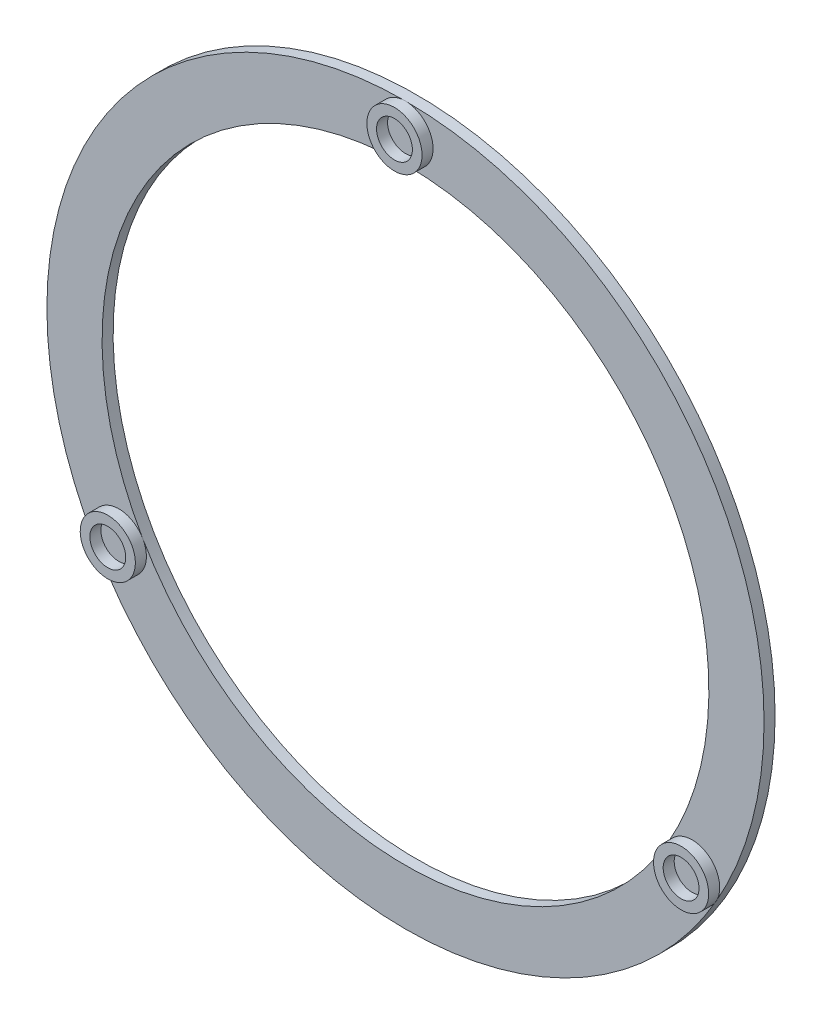
ISO-10303-21;
HEADER;
FILE_DESCRIPTION(('STEP AP214'),'2;1');
FILE_NAME('part.step','',(''),(''),'','','');
FILE_SCHEMA(('AUTOMOTIVE_DESIGN { 1 0 10303 214 1 1 1 1 }'));
ENDSEC;
DATA;
#1=APPLICATION_CONTEXT('core data for automotive mechanical design processes');
#2=APPLICATION_PROTOCOL_DEFINITION('international standard','automotive_design',2000,#1);
#3=PRODUCT_CONTEXT('',#1,'mechanical');
#4=PRODUCT('Part','Part','',(#3));
#5=PRODUCT_RELATED_PRODUCT_CATEGORY('part','',(#4));
#6=PRODUCT_DEFINITION_FORMATION('','',#4);
#7=PRODUCT_DEFINITION_CONTEXT('part definition',#1,'design');
#8=PRODUCT_DEFINITION('design','',#6,#7);
#9=PRODUCT_DEFINITION_SHAPE('','',#8);
#10=(LENGTH_UNIT() NAMED_UNIT(*) SI_UNIT(.MILLI.,.METRE.));
#11=(NAMED_UNIT(*) PLANE_ANGLE_UNIT() SI_UNIT($,.RADIAN.));
#12=(NAMED_UNIT(*) SI_UNIT($,.STERADIAN.) SOLID_ANGLE_UNIT());
#13=UNCERTAINTY_MEASURE_WITH_UNIT(LENGTH_MEASURE(1.E-05),#10,'distance_accuracy_value','');
#14=(GEOMETRIC_REPRESENTATION_CONTEXT(3) GLOBAL_UNCERTAINTY_ASSIGNED_CONTEXT((#13)) GLOBAL_UNIT_ASSIGNED_CONTEXT((#10,
#11,#12)) REPRESENTATION_CONTEXT('',''));
#15=CARTESIAN_POINT('',(0.,0.,0.));
#16=DIRECTION('',(0.,0.,1.));
#17=DIRECTION('',(1.,0.,0.));
#18=AXIS2_PLACEMENT_3D('',#15,#16,#17);
#19=CARTESIAN_POINT('',(0.,0.,10.));
#20=DIRECTION('',(0.,0.,1.));
#21=DIRECTION('',(1.,0.,0.));
#22=AXIS2_PLACEMENT_3D('',#19,#20,#21);
#23=PLANE('',#22);
#24=CARTESIAN_POINT('',(0.,0.,10.));
#25=DIRECTION('',(0.,0.,1.));
#26=DIRECTION('',(1.,0.,0.));
#27=AXIS2_PLACEMENT_3D('',#24,#25,#26);
#28=CIRCLE('',#27,325.);
#29=CARTESIAN_POINT('',(0.,325.,10.));
#30=VERTEX_POINT('',#29);
#31=CARTESIAN_POINT('',(-281.458256229933,-162.500000000017,10.));
#32=VERTEX_POINT('',#31);
#33=EDGE_CURVE('E79',#30,#32,#28,.T.);
#34=ORIENTED_EDGE('',*,*,#33,.T.);
#35=CARTESIAN_POINT('',(-259.807621135314,-150.00000000001,10.));
#36=DIRECTION('',(0.,0.,1.));
#37=DIRECTION('',(1.,0.,0.));
#38=AXIS2_PLACEMENT_3D('',#35,#36,#37);
#39=CIRCLE('',#38,25.0000000000224);
#40=CARTESIAN_POINT('',(-238.156986040687,-137.499999999999,10.));
#41=VERTEX_POINT('',#40);
#42=EDGE_CURVE('E47',#41,#32,#39,.T.);
#43=ORIENTED_EDGE('',*,*,#42,.F.);
#44=CARTESIAN_POINT('',(0.,0.,10.));
#45=DIRECTION('',(0.,0.,1.));
#46=DIRECTION('',(1.,0.,0.));
#47=AXIS2_PLACEMENT_3D('',#44,#45,#46);
#48=CIRCLE('',#47,275.);
#49=CARTESIAN_POINT('',(0.,275.,10.));
#50=VERTEX_POINT('',#49);
#51=EDGE_CURVE('E76',#50,#41,#48,.T.);
#52=ORIENTED_EDGE('',*,*,#51,.F.);
#53=CARTESIAN_POINT('',(0.,300.,10.));
#54=DIRECTION('',(0.,0.,1.));
#55=DIRECTION('',(1.,0.,0.));
#56=AXIS2_PLACEMENT_3D('',#53,#54,#55);
#57=CIRCLE('',#56,24.9999999999999);
#58=EDGE_CURVE('E104',#30,#50,#57,.T.);
#59=ORIENTED_EDGE('',*,*,#58,.F.);
#60=EDGE_LOOP('',(#34,#43,#52,#59));
#61=FACE_BOUND('',#60,.T.);
#62=ADVANCED_FACE('F33',(#61),#23,.T.);
#63=CARTESIAN_POINT('',(238.156986040725,-137.499999999984,10.));
#64=VERTEX_POINT('',#63);
#65=EDGE_CURVE('E81',#41,#64,#48,.T.);
#66=ORIENTED_EDGE('',*,*,#65,.F.);
#67=EDGE_CURVE('E66',#32,#41,#39,.T.);
#68=ORIENTED_EDGE('',*,*,#67,.F.);
#69=CARTESIAN_POINT('',(281.458256229952,-162.499999999984,10.));
#70=VERTEX_POINT('',#69);
#71=EDGE_CURVE('E54',#32,#70,#28,.T.);
#72=ORIENTED_EDGE('',*,*,#71,.T.);
#73=CARTESIAN_POINT('',(259.807621135349,-149.99999999999,10.));
#74=DIRECTION('',(0.,0.,1.));
#75=DIRECTION('',(1.,0.,0.));
#76=AXIS2_PLACEMENT_3D('',#73,#74,#75);
#77=CIRCLE('',#76,25.0000000000151);
#78=EDGE_CURVE('E83',#64,#70,#77,.T.);
#79=ORIENTED_EDGE('',*,*,#78,.F.);
#80=EDGE_LOOP('',(#66,#68,#72,#79));
#81=FACE_BOUND('',#80,.T.);
#82=ADVANCED_FACE('F82',(#81),#23,.T.);
#83=EDGE_CURVE('E87',#64,#50,#48,.T.);
#84=ORIENTED_EDGE('',*,*,#83,.F.);
#85=EDGE_CURVE('E124',#70,#64,#77,.T.);
#86=ORIENTED_EDGE('',*,*,#85,.F.);
#87=EDGE_CURVE('E94',#70,#30,#28,.T.);
#88=ORIENTED_EDGE('',*,*,#87,.T.);
#89=EDGE_CURVE('E107',#50,#30,#57,.T.);
#90=ORIENTED_EDGE('',*,*,#89,.F.);
#91=EDGE_LOOP('',(#84,#86,#88,#90));
#92=FACE_BOUND('',#91,.T.);
#93=ADVANCED_FACE('F156',(#92),#23,.T.);
#94=CARTESIAN_POINT('',(0.,0.,0.));
#95=DIRECTION('',(0.,0.,1.));
#96=DIRECTION('',(1.,0.,0.));
#97=AXIS2_PLACEMENT_3D('',#94,#95,#96);
#98=PLANE('',#97);
#99=CARTESIAN_POINT('',(0.,0.,0.));
#100=DIRECTION('',(0.,0.,1.));
#101=DIRECTION('',(1.,0.,0.));
#102=AXIS2_PLACEMENT_3D('',#99,#100,#101);
#103=CIRCLE('',#102,325.);
#104=CARTESIAN_POINT('',(325.,0.,0.));
#105=VERTEX_POINT('',#104);
#106=EDGE_CURVE('E92',#105,#105,#103,.T.);
#107=ORIENTED_EDGE('',*,*,#106,.F.);
#108=EDGE_LOOP('',(#107));
#109=FACE_BOUND('',#108,.T.);
#110=CARTESIAN_POINT('',(0.,0.,0.));
#111=DIRECTION('',(0.,0.,1.));
#112=DIRECTION('',(1.,0.,0.));
#113=AXIS2_PLACEMENT_3D('',#110,#111,#112);
#114=CIRCLE('',#113,275.);
#115=CARTESIAN_POINT('',(275.,0.,0.));
#116=VERTEX_POINT('',#115);
#117=EDGE_CURVE('E98',#116,#116,#114,.T.);
#118=ORIENTED_EDGE('',*,*,#117,.T.);
#119=EDGE_LOOP('',(#118));
#120=FACE_BOUND('',#119,.T.);
#121=ADVANCED_FACE('F164',(#109,#120),#98,.F.);
#122=CARTESIAN_POINT('',(0.,0.,10.));
#123=DIRECTION('',(0.,0.,-1.));
#124=DIRECTION('',(-1.,0.,0.));
#125=AXIS2_PLACEMENT_3D('',#122,#123,#124);
#126=CYLINDRICAL_SURFACE('',#125,325.);
#127=ORIENTED_EDGE('',*,*,#33,.F.);
#128=ORIENTED_EDGE('',*,*,#87,.F.);
#129=ORIENTED_EDGE('',*,*,#71,.F.);
#130=EDGE_LOOP('',(#127,#128,#129));
#131=FACE_BOUND('',#130,.T.);
#132=ORIENTED_EDGE('',*,*,#106,.T.);
#133=EDGE_LOOP('',(#132));
#134=FACE_BOUND('',#133,.T.);
#135=ADVANCED_FACE('F35',(#131,#134),#126,.T.);
#136=CARTESIAN_POINT('',(0.,0.,10.));
#137=DIRECTION('',(0.,0.,-1.));
#138=DIRECTION('',(-1.,0.,0.));
#139=AXIS2_PLACEMENT_3D('',#136,#137,#138);
#140=CYLINDRICAL_SURFACE('',#139,275.);
#141=ORIENTED_EDGE('',*,*,#51,.T.);
#142=ORIENTED_EDGE('',*,*,#65,.T.);
#143=ORIENTED_EDGE('',*,*,#83,.T.);
#144=EDGE_LOOP('',(#141,#142,#143));
#145=FACE_BOUND('',#144,.T.);
#146=ORIENTED_EDGE('',*,*,#117,.F.);
#147=EDGE_LOOP('',(#146));
#148=FACE_BOUND('',#147,.T.);
#149=ADVANCED_FACE('F89',(#145,#148),#140,.F.);
#150=CARTESIAN_POINT('',(0.,300.,20.));
#151=DIRECTION('',(0.,0.,1.));
#152=DIRECTION('',(1.,0.,0.));
#153=AXIS2_PLACEMENT_3D('',#150,#151,#152);
#154=PLANE('',#153);
#155=CARTESIAN_POINT('',(0.,300.,20.));
#156=DIRECTION('',(0.,0.,1.));
#157=DIRECTION('',(1.,0.,0.));
#158=AXIS2_PLACEMENT_3D('',#155,#156,#157);
#159=CIRCLE('',#158,24.9999999999999);
#160=CARTESIAN_POINT('',(24.9999999999999,300.,20.));
#161=VERTEX_POINT('',#160);
#162=EDGE_CURVE('E100',#161,#161,#159,.T.);
#163=ORIENTED_EDGE('',*,*,#162,.T.);
#164=EDGE_LOOP('',(#163));
#165=FACE_BOUND('',#164,.T.);
#166=CARTESIAN_POINT('',(0.,300.,20.));
#167=DIRECTION('',(0.,0.,1.));
#168=DIRECTION('',(1.,0.,0.));
#169=AXIS2_PLACEMENT_3D('',#166,#167,#168);
#170=CIRCLE('',#169,16.25);
#171=CARTESIAN_POINT('',(16.25,300.,20.));
#172=VERTEX_POINT('',#171);
#173=EDGE_CURVE('E113',#172,#172,#170,.T.);
#174=ORIENTED_EDGE('',*,*,#173,.F.);
#175=EDGE_LOOP('',(#174));
#176=FACE_BOUND('',#175,.T.);
#177=ADVANCED_FACE('F188',(#165,#176),#154,.T.);
#178=CARTESIAN_POINT('',(0.,300.,20.));
#179=DIRECTION('',(0.,0.,-1.));
#180=DIRECTION('',(-1.,0.,0.));
#181=AXIS2_PLACEMENT_3D('',#178,#179,#180);
#182=CYLINDRICAL_SURFACE('',#181,24.9999999999999);
#183=ORIENTED_EDGE('',*,*,#162,.F.);
#184=EDGE_LOOP('',(#183));
#185=FACE_BOUND('',#184,.T.);
#186=ORIENTED_EDGE('',*,*,#58,.T.);
#187=ORIENTED_EDGE('',*,*,#89,.T.);
#188=EDGE_LOOP('',(#186,#187));
#189=FACE_BOUND('',#188,.T.);
#190=ADVANCED_FACE('F181',(#185,#189),#182,.T.);
#191=CARTESIAN_POINT('',(0.,300.,20.));
#192=DIRECTION('',(0.,0.,-1.));
#193=DIRECTION('',(-1.,0.,0.));
#194=AXIS2_PLACEMENT_3D('',#191,#192,#193);
#195=CYLINDRICAL_SURFACE('',#194,16.25);
#196=ORIENTED_EDGE('',*,*,#173,.T.);
#197=EDGE_LOOP('',(#196));
#198=FACE_BOUND('',#197,.T.);
#199=CARTESIAN_POINT('',(0.,300.,10.));
#200=DIRECTION('',(0.,0.,1.));
#201=DIRECTION('',(1.,0.,0.));
#202=AXIS2_PLACEMENT_3D('',#199,#200,#201);
#203=CIRCLE('',#202,16.25);
#204=CARTESIAN_POINT('',(16.25,300.,10.));
#205=VERTEX_POINT('',#204);
#206=EDGE_CURVE('E115',#205,#205,#203,.T.);
#207=ORIENTED_EDGE('',*,*,#206,.F.);
#208=EDGE_LOOP('',(#207));
#209=FACE_BOUND('',#208,.T.);
#210=ADVANCED_FACE('F172',(#198,#209),#195,.F.);
#211=ORIENTED_EDGE('',*,*,#206,.T.);
#212=EDGE_LOOP('',(#211));
#213=FACE_BOUND('',#212,.T.);
#214=ADVANCED_FACE('F152',(#213),#23,.T.);
#215=CARTESIAN_POINT('',(259.807621135349,-149.99999999999,20.));
#216=DIRECTION('',(0.,0.,1.));
#217=DIRECTION('',(1.,0.,0.));
#218=AXIS2_PLACEMENT_3D('',#215,#216,#217);
#219=PLANE('',#218);
#220=CARTESIAN_POINT('',(259.807621135349,-149.99999999999,20.));
#221=DIRECTION('',(0.,0.,1.));
#222=DIRECTION('',(1.,0.,0.));
#223=AXIS2_PLACEMENT_3D('',#220,#221,#222);
#224=CIRCLE('',#223,25.0000000000151);
#225=CARTESIAN_POINT('',(284.807621135364,-149.99999999999,20.));
#226=VERTEX_POINT('',#225);
#227=EDGE_CURVE('E120',#226,#226,#224,.T.);
#228=ORIENTED_EDGE('',*,*,#227,.T.);
#229=EDGE_LOOP('',(#228));
#230=FACE_BOUND('',#229,.T.);
#231=CARTESIAN_POINT('',(259.807621135349,-149.99999999999,20.));
#232=DIRECTION('',(0.,0.,1.));
#233=DIRECTION('',(1.,0.,0.));
#234=AXIS2_PLACEMENT_3D('',#231,#232,#233);
#235=CIRCLE('',#234,16.2500000000152);
#236=CARTESIAN_POINT('',(276.057621135364,-149.99999999999,20.));
#237=VERTEX_POINT('',#236);
#238=EDGE_CURVE('E127',#237,#237,#235,.T.);
#239=ORIENTED_EDGE('',*,*,#238,.F.);
#240=EDGE_LOOP('',(#239));
#241=FACE_BOUND('',#240,.T.);
#242=ADVANCED_FACE('F171',(#230,#241),#219,.T.);
#243=CARTESIAN_POINT('',(259.807621135349,-149.99999999999,20.));
#244=DIRECTION('',(0.,0.,-1.));
#245=DIRECTION('',(-1.,0.,0.));
#246=AXIS2_PLACEMENT_3D('',#243,#244,#245);
#247=CYLINDRICAL_SURFACE('',#246,25.0000000000151);
#248=ORIENTED_EDGE('',*,*,#227,.F.);
#249=EDGE_LOOP('',(#248));
#250=FACE_BOUND('',#249,.T.);
#251=ORIENTED_EDGE('',*,*,#78,.T.);
#252=ORIENTED_EDGE('',*,*,#85,.T.);
#253=EDGE_LOOP('',(#251,#252));
#254=FACE_BOUND('',#253,.T.);
#255=ADVANCED_FACE('F178',(#250,#254),#247,.T.);
#256=CARTESIAN_POINT('',(259.807621135349,-149.99999999999,20.));
#257=DIRECTION('',(0.,0.,-1.));
#258=DIRECTION('',(-1.,0.,0.));
#259=AXIS2_PLACEMENT_3D('',#256,#257,#258);
#260=CYLINDRICAL_SURFACE('',#259,16.2500000000152);
#261=ORIENTED_EDGE('',*,*,#238,.T.);
#262=EDGE_LOOP('',(#261));
#263=FACE_BOUND('',#262,.T.);
#264=CARTESIAN_POINT('',(259.807621135349,-149.99999999999,10.));
#265=DIRECTION('',(0.,0.,1.));
#266=DIRECTION('',(1.,0.,0.));
#267=AXIS2_PLACEMENT_3D('',#264,#265,#266);
#268=CIRCLE('',#267,16.2500000000152);
#269=CARTESIAN_POINT('',(276.057621135364,-149.99999999999,10.));
#270=VERTEX_POINT('',#269);
#271=EDGE_CURVE('E41',#270,#270,#268,.F.);
#272=ORIENTED_EDGE('',*,*,#271,.T.);
#273=EDGE_LOOP('',(#272));
#274=FACE_BOUND('',#273,.T.);
#275=ADVANCED_FACE('F149',(#263,#274),#260,.F.);
#276=ORIENTED_EDGE('',*,*,#271,.F.);
#277=EDGE_LOOP('',(#276));
#278=FACE_BOUND('',#277,.T.);
#279=ADVANCED_FACE('F140',(#278),#23,.T.);
#280=CARTESIAN_POINT('',(-259.807621135314,-150.00000000001,20.));
#281=DIRECTION('',(0.,0.,1.));
#282=DIRECTION('',(1.,0.,0.));
#283=AXIS2_PLACEMENT_3D('',#280,#281,#282);
#284=PLANE('',#283);
#285=CARTESIAN_POINT('',(-259.807621135314,-150.00000000001,20.));
#286=DIRECTION('',(0.,0.,1.));
#287=DIRECTION('',(1.,0.,0.));
#288=AXIS2_PLACEMENT_3D('',#285,#286,#287);
#289=CIRCLE('',#288,25.0000000000224);
#290=CARTESIAN_POINT('',(-234.807621135292,-150.00000000001,20.));
#291=VERTEX_POINT('',#290);
#292=EDGE_CURVE('E80',#291,#291,#289,.T.);
#293=ORIENTED_EDGE('',*,*,#292,.T.);
#294=EDGE_LOOP('',(#293));
#295=FACE_BOUND('',#294,.T.);
#296=CARTESIAN_POINT('',(-259.807621135314,-150.00000000001,20.));
#297=DIRECTION('',(0.,0.,1.));
#298=DIRECTION('',(1.,0.,0.));
#299=AXIS2_PLACEMENT_3D('',#296,#297,#298);
#300=CIRCLE('',#299,16.2500000000224);
#301=CARTESIAN_POINT('',(-243.557621135292,-150.00000000001,20.));
#302=VERTEX_POINT('',#301);
#303=EDGE_CURVE('E69',#302,#302,#300,.T.);
#304=ORIENTED_EDGE('',*,*,#303,.F.);
#305=EDGE_LOOP('',(#304));
#306=FACE_BOUND('',#305,.T.);
#307=ADVANCED_FACE('F138',(#295,#306),#284,.T.);
#308=CARTESIAN_POINT('',(-259.807621135314,-150.00000000001,20.));
#309=DIRECTION('',(0.,0.,-1.));
#310=DIRECTION('',(-1.,0.,0.));
#311=AXIS2_PLACEMENT_3D('',#308,#309,#310);
#312=CYLINDRICAL_SURFACE('',#311,25.0000000000224);
#313=ORIENTED_EDGE('',*,*,#292,.F.);
#314=EDGE_LOOP('',(#313));
#315=FACE_BOUND('',#314,.T.);
#316=ORIENTED_EDGE('',*,*,#42,.T.);
#317=ORIENTED_EDGE('',*,*,#67,.T.);
#318=EDGE_LOOP('',(#316,#317));
#319=FACE_BOUND('',#318,.T.);
#320=ADVANCED_FACE('F67',(#315,#319),#312,.T.);
#321=CARTESIAN_POINT('',(-259.807621135314,-150.00000000001,20.));
#322=DIRECTION('',(0.,0.,-1.));
#323=DIRECTION('',(-1.,0.,0.));
#324=AXIS2_PLACEMENT_3D('',#321,#322,#323);
#325=CYLINDRICAL_SURFACE('',#324,16.2500000000224);
#326=ORIENTED_EDGE('',*,*,#303,.T.);
#327=EDGE_LOOP('',(#326));
#328=FACE_BOUND('',#327,.T.);
#329=CARTESIAN_POINT('',(-259.807621135314,-150.00000000001,10.));
#330=DIRECTION('',(0.,0.,1.));
#331=DIRECTION('',(1.,0.,0.));
#332=AXIS2_PLACEMENT_3D('',#329,#330,#331);
#333=CIRCLE('',#332,16.2500000000224);
#334=CARTESIAN_POINT('',(-243.557621135292,-150.00000000001,10.));
#335=VERTEX_POINT('',#334);
#336=EDGE_CURVE('E11',#335,#335,#333,.F.);
#337=ORIENTED_EDGE('',*,*,#336,.T.);
#338=EDGE_LOOP('',(#337));
#339=FACE_BOUND('',#338,.T.);
#340=ADVANCED_FACE('F135',(#328,#339),#325,.F.);
#341=ORIENTED_EDGE('',*,*,#336,.F.);
#342=EDGE_LOOP('',(#341));
#343=FACE_BOUND('',#342,.T.);
#344=ADVANCED_FACE('F155',(#343),#23,.T.);
#345=CLOSED_SHELL('',(#62,#82,#93,#121,#135,#149,#177,#190,#210,#214,#242,#255,#275,#279,#307,
#320,#340,#344));
#346=MANIFOLD_SOLID_BREP('B2',#345);
#347=ADVANCED_BREP_SHAPE_REPRESENTATION('',(#18,#346),#14);
#348=SHAPE_DEFINITION_REPRESENTATION(#9,#347);
ENDSEC;
END-ISO-10303-21;
